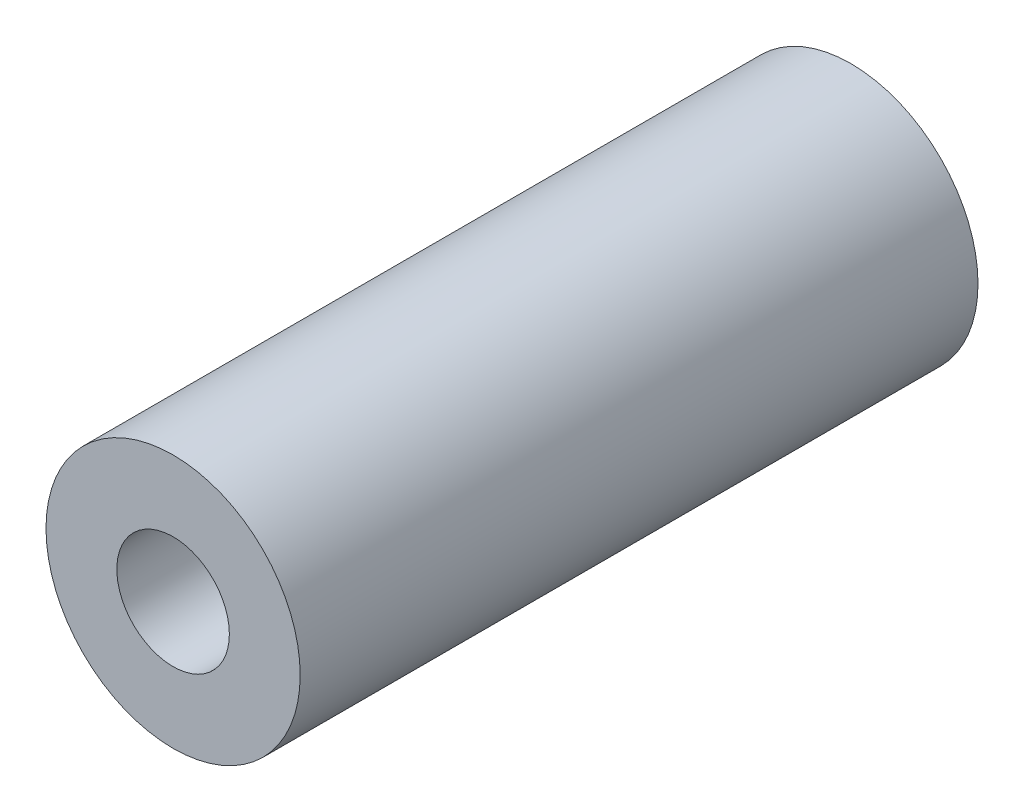
ISO-10303-21;
HEADER;
FILE_DESCRIPTION(('STEP AP214'),'2;1');
FILE_NAME('part.step','',(''),(''),'','','');
FILE_SCHEMA(('AUTOMOTIVE_DESIGN { 1 0 10303 214 1 1 1 1 }'));
ENDSEC;
DATA;
#1=APPLICATION_CONTEXT('core data for automotive mechanical design processes');
#2=APPLICATION_PROTOCOL_DEFINITION('international standard','automotive_design',2000,#1);
#3=PRODUCT_CONTEXT('',#1,'mechanical');
#4=PRODUCT('Part','Part','',(#3));
#5=PRODUCT_RELATED_PRODUCT_CATEGORY('part','',(#4));
#6=PRODUCT_DEFINITION_FORMATION('','',#4);
#7=PRODUCT_DEFINITION_CONTEXT('part definition',#1,'design');
#8=PRODUCT_DEFINITION('design','',#6,#7);
#9=PRODUCT_DEFINITION_SHAPE('','',#8);
#10=(LENGTH_UNIT() NAMED_UNIT(*) SI_UNIT(.MILLI.,.METRE.));
#11=(NAMED_UNIT(*) PLANE_ANGLE_UNIT() SI_UNIT($,.RADIAN.));
#12=(NAMED_UNIT(*) SI_UNIT($,.STERADIAN.) SOLID_ANGLE_UNIT());
#13=UNCERTAINTY_MEASURE_WITH_UNIT(LENGTH_MEASURE(1.E-05),#10,'distance_accuracy_value','');
#14=(GEOMETRIC_REPRESENTATION_CONTEXT(3) GLOBAL_UNCERTAINTY_ASSIGNED_CONTEXT((#13)) GLOBAL_UNIT_ASSIGNED_CONTEXT((#10,
#11,#12)) REPRESENTATION_CONTEXT('',''));
#15=CARTESIAN_POINT('',(0.,0.,0.));
#16=DIRECTION('',(0.,0.,1.));
#17=DIRECTION('',(1.,0.,0.));
#18=AXIS2_PLACEMENT_3D('',#15,#16,#17);
#19=CARTESIAN_POINT('',(0.,0.,-12.7));
#20=DIRECTION('',(0.,0.,-1.));
#21=DIRECTION('',(1.,0.,0.));
#22=AXIS2_PLACEMENT_3D('',#19,#20,#21);
#23=PLANE('',#22);
#24=CARTESIAN_POINT('',(0.,0.,-12.7));
#25=DIRECTION('',(0.,0.,1.));
#26=DIRECTION('',(1.,0.,0.));
#27=AXIS2_PLACEMENT_3D('',#24,#25,#26);
#28=CIRCLE('',#27,4.7625);
#29=CARTESIAN_POINT('',(4.7625,0.,-12.7));
#30=VERTEX_POINT('',#29);
#31=EDGE_CURVE('E10',#30,#30,#28,.T.);
#32=ORIENTED_EDGE('',*,*,#31,.F.);
#33=EDGE_LOOP('',(#32));
#34=FACE_BOUND('',#33,.T.);
#35=CARTESIAN_POINT('',(0.,0.,-12.7));
#36=DIRECTION('',(0.,0.,1.));
#37=DIRECTION('',(1.,0.,0.));
#38=AXIS2_PLACEMENT_3D('',#35,#36,#37);
#39=CIRCLE('',#38,2.1082);
#40=CARTESIAN_POINT('',(2.1082,0.,-12.7));
#41=VERTEX_POINT('',#40);
#42=EDGE_CURVE('E40',#41,#41,#39,.T.);
#43=ORIENTED_EDGE('',*,*,#42,.T.);
#44=EDGE_LOOP('',(#43));
#45=FACE_BOUND('',#44,.T.);
#46=ADVANCED_FACE('F33',(#34,#45),#23,.T.);
#47=CARTESIAN_POINT('',(0.,0.,-12.7));
#48=DIRECTION('',(0.,0.,1.));
#49=DIRECTION('',(-1.,0.,0.));
#50=AXIS2_PLACEMENT_3D('',#47,#48,#49);
#51=CYLINDRICAL_SURFACE('',#50,4.7625);
#52=ORIENTED_EDGE('',*,*,#31,.T.);
#53=EDGE_LOOP('',(#52));
#54=FACE_BOUND('',#53,.T.);
#55=CARTESIAN_POINT('',(0.,0.,12.7));
#56=DIRECTION('',(0.,0.,1.));
#57=DIRECTION('',(1.,0.,0.));
#58=AXIS2_PLACEMENT_3D('',#55,#56,#57);
#59=CIRCLE('',#58,4.7625);
#60=CARTESIAN_POINT('',(4.7625,0.,12.7));
#61=VERTEX_POINT('',#60);
#62=EDGE_CURVE('E44',#61,#61,#59,.T.);
#63=ORIENTED_EDGE('',*,*,#62,.F.);
#64=EDGE_LOOP('',(#63));
#65=FACE_BOUND('',#64,.T.);
#66=ADVANCED_FACE('F35',(#54,#65),#51,.T.);
#67=CARTESIAN_POINT('',(0.,0.,-12.7));
#68=DIRECTION('',(0.,0.,1.));
#69=DIRECTION('',(-1.,0.,0.));
#70=AXIS2_PLACEMENT_3D('',#67,#68,#69);
#71=CYLINDRICAL_SURFACE('',#70,2.1082);
#72=ORIENTED_EDGE('',*,*,#42,.F.);
#73=EDGE_LOOP('',(#72));
#74=FACE_BOUND('',#73,.T.);
#75=CARTESIAN_POINT('',(0.,0.,12.7));
#76=DIRECTION('',(0.,0.,1.));
#77=DIRECTION('',(1.,0.,0.));
#78=AXIS2_PLACEMENT_3D('',#75,#76,#77);
#79=CIRCLE('',#78,2.1082);
#80=CARTESIAN_POINT('',(2.1082,0.,12.7));
#81=VERTEX_POINT('',#80);
#82=EDGE_CURVE('E48',#81,#81,#79,.T.);
#83=ORIENTED_EDGE('',*,*,#82,.T.);
#84=EDGE_LOOP('',(#83));
#85=FACE_BOUND('',#84,.T.);
#86=ADVANCED_FACE('F54',(#74,#85),#71,.F.);
#87=CARTESIAN_POINT('',(0.,0.,12.7));
#88=DIRECTION('',(0.,0.,-1.));
#89=DIRECTION('',(1.,0.,0.));
#90=AXIS2_PLACEMENT_3D('',#87,#88,#89);
#91=PLANE('',#90);
#92=ORIENTED_EDGE('',*,*,#82,.F.);
#93=EDGE_LOOP('',(#92));
#94=FACE_BOUND('',#93,.T.);
#95=ORIENTED_EDGE('',*,*,#62,.T.);
#96=EDGE_LOOP('',(#95));
#97=FACE_BOUND('',#96,.T.);
#98=ADVANCED_FACE('F56',(#94,#97),#91,.F.);
#99=CLOSED_SHELL('',(#46,#66,#86,#98));
#100=MANIFOLD_SOLID_BREP('B2',#99);
#101=ADVANCED_BREP_SHAPE_REPRESENTATION('',(#18,#100),#14);
#102=SHAPE_DEFINITION_REPRESENTATION(#9,#101);
ENDSEC;
END-ISO-10303-21;
